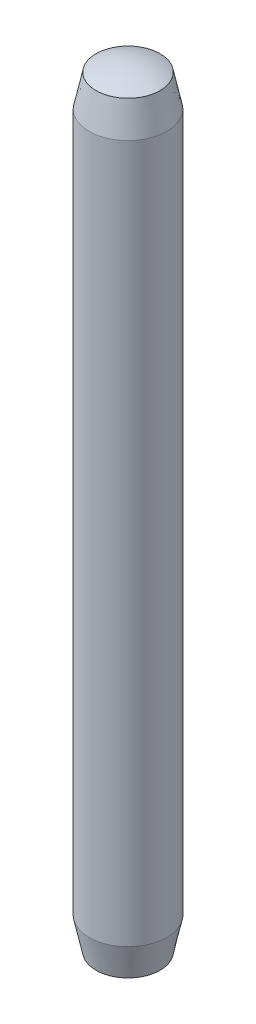
ISO-10303-21;
HEADER;
FILE_DESCRIPTION(('STEP AP214'),'2;1');
FILE_NAME('part.step','',(''),(''),'','','');
FILE_SCHEMA(('AUTOMOTIVE_DESIGN { 1 0 10303 214 1 1 1 1 }'));
ENDSEC;
DATA;
#1=APPLICATION_CONTEXT('core data for automotive mechanical design processes');
#2=APPLICATION_PROTOCOL_DEFINITION('international standard','automotive_design',2000,#1);
#3=PRODUCT_CONTEXT('',#1,'mechanical');
#4=PRODUCT('Part','Part','',(#3));
#5=PRODUCT_RELATED_PRODUCT_CATEGORY('part','',(#4));
#6=PRODUCT_DEFINITION_FORMATION('','',#4);
#7=PRODUCT_DEFINITION_CONTEXT('part definition',#1,'design');
#8=PRODUCT_DEFINITION('design','',#6,#7);
#9=PRODUCT_DEFINITION_SHAPE('','',#8);
#10=(LENGTH_UNIT() NAMED_UNIT(*) SI_UNIT(.MILLI.,.METRE.));
#11=(NAMED_UNIT(*) PLANE_ANGLE_UNIT() SI_UNIT($,.RADIAN.));
#12=(NAMED_UNIT(*) SI_UNIT($,.STERADIAN.) SOLID_ANGLE_UNIT());
#13=UNCERTAINTY_MEASURE_WITH_UNIT(LENGTH_MEASURE(1.E-05),#10,'distance_accuracy_value','');
#14=(GEOMETRIC_REPRESENTATION_CONTEXT(3) GLOBAL_UNCERTAINTY_ASSIGNED_CONTEXT((#13)) GLOBAL_UNIT_ASSIGNED_CONTEXT((#10,
#11,#12)) REPRESENTATION_CONTEXT('',''));
#15=CARTESIAN_POINT('',(0.,0.,0.));
#16=DIRECTION('',(0.,0.,1.));
#17=DIRECTION('',(1.,0.,0.));
#18=AXIS2_PLACEMENT_3D('',#15,#16,#17);
#19=CARTESIAN_POINT('',(0.,10.,0.));
#20=DIRECTION('',(0.,-1.,0.));
#21=DIRECTION('',(0.,0.,-1.));
#22=AXIS2_PLACEMENT_3D('',#19,#20,#21);
#23=CYLINDRICAL_SURFACE('',#22,0.5);
#24=CARTESIAN_POINT('',(0.,9.5,0.));
#25=DIRECTION('',(0.,-1.,0.));
#26=DIRECTION('',(1.,0.,0.));
#27=AXIS2_PLACEMENT_3D('',#24,#25,#26);
#28=CIRCLE('',#27,0.500000000000001);
#29=CARTESIAN_POINT('',(0.500000000000001,9.5,0.));
#30=VERTEX_POINT('',#29);
#31=EDGE_CURVE('E11',#30,#30,#28,.T.);
#32=ORIENTED_EDGE('',*,*,#31,.T.);
#33=EDGE_LOOP('',(#32));
#34=FACE_BOUND('',#33,.T.);
#35=CARTESIAN_POINT('',(0.,0.5,0.));
#36=DIRECTION('',(0.,-1.,0.));
#37=DIRECTION('',(1.,0.,0.));
#38=AXIS2_PLACEMENT_3D('',#35,#36,#37);
#39=CIRCLE('',#38,0.500000000000001);
#40=CARTESIAN_POINT('',(0.500000000000001,0.5,0.));
#41=VERTEX_POINT('',#40);
#42=EDGE_CURVE('E56',#41,#41,#39,.T.);
#43=ORIENTED_EDGE('',*,*,#42,.F.);
#44=EDGE_LOOP('',(#43));
#45=FACE_BOUND('',#44,.T.);
#46=ADVANCED_FACE('F34',(#34,#45),#23,.T.);
#47=CARTESIAN_POINT('',(0.,9.5,0.));
#48=DIRECTION('',(0.,-1.,0.));
#49=DIRECTION('',(1.,0.,0.));
#50=AXIS2_PLACEMENT_3D('',#47,#48,#49);
#51=CONICAL_SURFACE('',#50,0.500000000000001,0.209439510239313);
#52=CARTESIAN_POINT('',(0.,9.91088329307542,0.));
#53=DIRECTION('',(0.,-1.,0.));
#54=DIRECTION('',(1.,0.,0.));
#55=AXIS2_PLACEMENT_3D('',#52,#53,#54);
#56=CIRCLE('',#55,0.412664059976236);
#57=CARTESIAN_POINT('',(0.412664059976236,9.91088329307542,0.));
#58=VERTEX_POINT('',#57);
#59=EDGE_CURVE('E41',#58,#58,#56,.T.);
#60=ORIENTED_EDGE('',*,*,#59,.T.);
#61=EDGE_LOOP('',(#60));
#62=FACE_BOUND('',#61,.T.);
#63=ORIENTED_EDGE('',*,*,#31,.F.);
#64=EDGE_LOOP('',(#63));
#65=FACE_BOUND('',#64,.T.);
#66=ADVANCED_FACE('F51',(#62,#65),#51,.T.);
#67=CARTESIAN_POINT('',(0.,9.,0.));
#68=DIRECTION('',(0.,-1.,0.));
#69=DIRECTION('',(1.,0.,0.));
#70=AXIS2_PLACEMENT_3D('',#67,#68,#69);
#71=SPHERICAL_SURFACE('',#70,0.999999999999999);
#72=CARTESIAN_POINT('',(0.,10.,0.));
#73=VERTEX_POINT('',#72);
#74=VERTEX_LOOP('',#73);
#75=FACE_BOUND('',#74,.T.);
#76=ORIENTED_EDGE('',*,*,#59,.F.);
#77=EDGE_LOOP('',(#76));
#78=FACE_BOUND('',#77,.T.);
#79=ADVANCED_FACE('F47',(#75,#78),#71,.T.);
#80=CARTESIAN_POINT('',(0.,0.0891167069245764,0.));
#81=DIRECTION('',(0.,1.,0.));
#82=DIRECTION('',(-1.,0.,0.));
#83=AXIS2_PLACEMENT_3D('',#80,#81,#82);
#84=CONICAL_SURFACE('',#83,0.412664059976236,0.209439510239313);
#85=ORIENTED_EDGE('',*,*,#42,.T.);
#86=EDGE_LOOP('',(#85));
#87=FACE_BOUND('',#86,.T.);
#88=CARTESIAN_POINT('',(0.,0.0891167069245764,0.));
#89=DIRECTION('',(0.,-1.,0.));
#90=DIRECTION('',(1.,0.,0.));
#91=AXIS2_PLACEMENT_3D('',#88,#89,#90);
#92=CIRCLE('',#91,0.412664059976236);
#93=CARTESIAN_POINT('',(0.412664059976236,0.0891167069245764,0.));
#94=VERTEX_POINT('',#93);
#95=EDGE_CURVE('E58',#94,#94,#92,.T.);
#96=ORIENTED_EDGE('',*,*,#95,.F.);
#97=EDGE_LOOP('',(#96));
#98=FACE_BOUND('',#97,.T.);
#99=ADVANCED_FACE('F50',(#87,#98),#84,.T.);
#100=CARTESIAN_POINT('',(0.,1.,0.));
#101=DIRECTION('',(0.,-1.,0.));
#102=DIRECTION('',(1.,0.,0.));
#103=AXIS2_PLACEMENT_3D('',#100,#101,#102);
#104=SPHERICAL_SURFACE('',#103,1.);
#105=CARTESIAN_POINT('',(0.,0.,0.));
#106=VERTEX_POINT('',#105);
#107=VERTEX_LOOP('',#106);
#108=FACE_BOUND('',#107,.T.);
#109=ORIENTED_EDGE('',*,*,#95,.T.);
#110=EDGE_LOOP('',(#109));
#111=FACE_BOUND('',#110,.T.);
#112=ADVANCED_FACE('F64',(#108,#111),#104,.T.);
#113=CLOSED_SHELL('',(#46,#66,#79,#99,#112));
#114=MANIFOLD_SOLID_BREP('B2',#113);
#115=ADVANCED_BREP_SHAPE_REPRESENTATION('',(#18,#114),#14);
#116=SHAPE_DEFINITION_REPRESENTATION(#9,#115);
ENDSEC;
END-ISO-10303-21;
